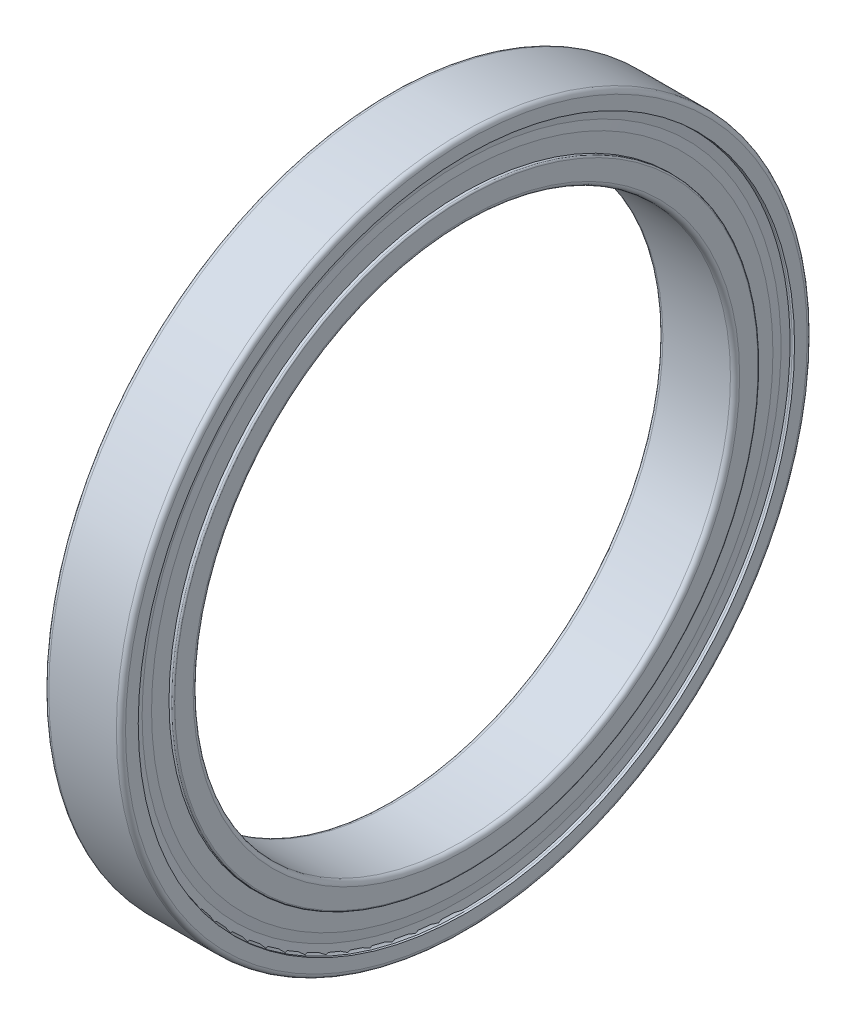
ISO-10303-21;
HEADER;
FILE_DESCRIPTION(('STEP AP214'),'2;1');
FILE_NAME('part.step','',(''),(''),'','','');
FILE_SCHEMA(('AUTOMOTIVE_DESIGN { 1 0 10303 214 1 1 1 1 }'));
ENDSEC;
DATA;
#1=APPLICATION_CONTEXT('core data for automotive mechanical design processes');
#2=APPLICATION_PROTOCOL_DEFINITION('international standard','automotive_design',2000,#1);
#3=PRODUCT_CONTEXT('',#1,'mechanical');
#4=PRODUCT('Part','Part','',(#3));
#5=PRODUCT_RELATED_PRODUCT_CATEGORY('part','',(#4));
#6=PRODUCT_DEFINITION_FORMATION('','',#4);
#7=PRODUCT_DEFINITION_CONTEXT('part definition',#1,'design');
#8=PRODUCT_DEFINITION('design','',#6,#7);
#9=PRODUCT_DEFINITION_SHAPE('','',#8);
#10=(LENGTH_UNIT() NAMED_UNIT(*) SI_UNIT(.MILLI.,.METRE.));
#11=(NAMED_UNIT(*) PLANE_ANGLE_UNIT() SI_UNIT($,.RADIAN.));
#12=(NAMED_UNIT(*) SI_UNIT($,.STERADIAN.) SOLID_ANGLE_UNIT());
#13=UNCERTAINTY_MEASURE_WITH_UNIT(LENGTH_MEASURE(1.E-05),#10,'distance_accuracy_value','');
#14=(GEOMETRIC_REPRESENTATION_CONTEXT(3) GLOBAL_UNCERTAINTY_ASSIGNED_CONTEXT((#13)) GLOBAL_UNIT_ASSIGNED_CONTEXT((#10,
#11,#12)) REPRESENTATION_CONTEXT('',''));
#15=CARTESIAN_POINT('',(0.,0.,0.));
#16=DIRECTION('',(0.,0.,1.));
#17=DIRECTION('',(1.,0.,0.));
#18=AXIS2_PLACEMENT_3D('',#15,#16,#17);
#19=CARTESIAN_POINT('',(5.,38.6370330515627,-10.3527618041008));
#20=DIRECTION('',(1.,0.,0.));
#21=DIRECTION('',(0.,0.965925826289068,-0.258819045102521));
#22=AXIS2_PLACEMENT_3D('',#19,#20,#21);
#23=SPHERICAL_SURFACE('',#22,2.778);
#24=CARTESIAN_POINT('',(7.778,38.6370330515627,-10.3527618041008));
#25=VERTEX_POINT('',#24);
#26=VERTEX_LOOP('',#25);
#27=FACE_BOUND('',#26,.T.);
#28=CARTESIAN_POINT('',(2.222,38.6370330515627,-10.3527618041008));
#29=VERTEX_POINT('',#28);
#30=VERTEX_LOOP('',#29);
#31=FACE_BOUND('',#30,.T.);
#32=ADVANCED_FACE('F46',(#27,#31),#23,.T.);
#33=CLOSED_SHELL('',(#32));
#34=MANIFOLD_SOLID_BREP('B2',#33);
#35=CARTESIAN_POINT('',(5.,34.6410161513775,-20.));
#36=DIRECTION('',(1.,0.,0.));
#37=DIRECTION('',(0.,0.866025403784438,-0.5));
#38=AXIS2_PLACEMENT_3D('',#35,#36,#37);
#39=SPHERICAL_SURFACE('',#38,2.778);
#40=CARTESIAN_POINT('',(7.778,34.6410161513775,-20.));
#41=VERTEX_POINT('',#40);
#42=VERTEX_LOOP('',#41);
#43=FACE_BOUND('',#42,.T.);
#44=CARTESIAN_POINT('',(2.222,34.6410161513775,-20.));
#45=VERTEX_POINT('',#44);
#46=VERTEX_LOOP('',#45);
#47=FACE_BOUND('',#46,.T.);
#48=ADVANCED_FACE('F73',(#43,#47),#39,.T.);
#49=CLOSED_SHELL('',(#48));
#50=MANIFOLD_SOLID_BREP('B6',#49);
#51=CARTESIAN_POINT('',(5.,28.2842712474619,-28.2842712474619));
#52=DIRECTION('',(1.,0.,0.));
#53=DIRECTION('',(0.,0.707106781186547,-0.707106781186548));
#54=AXIS2_PLACEMENT_3D('',#51,#52,#53);
#55=SPHERICAL_SURFACE('',#54,2.778);
#56=CARTESIAN_POINT('',(7.778,28.2842712474619,-28.2842712474619));
#57=VERTEX_POINT('',#56);
#58=VERTEX_LOOP('',#57);
#59=FACE_BOUND('',#58,.T.);
#60=CARTESIAN_POINT('',(2.222,28.2842712474619,-28.2842712474619));
#61=VERTEX_POINT('',#60);
#62=VERTEX_LOOP('',#61);
#63=FACE_BOUND('',#62,.T.);
#64=ADVANCED_FACE('F100',(#59,#63),#55,.T.);
#65=CLOSED_SHELL('',(#64));
#66=MANIFOLD_SOLID_BREP('B40',#65);
#67=CARTESIAN_POINT('',(5.,20.,-34.6410161513775));
#68=DIRECTION('',(1.,0.,0.));
#69=DIRECTION('',(0.,0.5,-0.866025403784439));
#70=AXIS2_PLACEMENT_3D('',#67,#68,#69);
#71=SPHERICAL_SURFACE('',#70,2.778);
#72=CARTESIAN_POINT('',(7.778,20.,-34.6410161513775));
#73=VERTEX_POINT('',#72);
#74=VERTEX_LOOP('',#73);
#75=FACE_BOUND('',#74,.T.);
#76=CARTESIAN_POINT('',(2.222,20.,-34.6410161513775));
#77=VERTEX_POINT('',#76);
#78=VERTEX_LOOP('',#77);
#79=FACE_BOUND('',#78,.T.);
#80=ADVANCED_FACE('F127',(#75,#79),#71,.T.);
#81=CLOSED_SHELL('',(#80));
#82=MANIFOLD_SOLID_BREP('B67',#81);
#83=CARTESIAN_POINT('',(5.,10.3527618041008,-38.6370330515627));
#84=DIRECTION('',(1.,0.,0.));
#85=DIRECTION('',(0.,0.25881904510252,-0.965925826289069));
#86=AXIS2_PLACEMENT_3D('',#83,#84,#85);
#87=SPHERICAL_SURFACE('',#86,2.778);
#88=CARTESIAN_POINT('',(7.778,10.3527618041008,-38.6370330515627));
#89=VERTEX_POINT('',#88);
#90=VERTEX_LOOP('',#89);
#91=FACE_BOUND('',#90,.T.);
#92=CARTESIAN_POINT('',(2.222,10.3527618041008,-38.6370330515627));
#93=VERTEX_POINT('',#92);
#94=VERTEX_LOOP('',#93);
#95=FACE_BOUND('',#94,.T.);
#96=ADVANCED_FACE('F154',(#91,#95),#87,.T.);
#97=CLOSED_SHELL('',(#96));
#98=MANIFOLD_SOLID_BREP('B94',#97);
#99=CARTESIAN_POINT('',(5.,0.,-40.));
#100=DIRECTION('',(1.,0.,0.));
#101=DIRECTION('',(0.,0.,-1.));
#102=AXIS2_PLACEMENT_3D('',#99,#100,#101);
#103=SPHERICAL_SURFACE('',#102,2.778);
#104=CARTESIAN_POINT('',(7.778,0.,-40.));
#105=VERTEX_POINT('',#104);
#106=VERTEX_LOOP('',#105);
#107=FACE_BOUND('',#106,.T.);
#108=CARTESIAN_POINT('',(2.222,0.,-40.));
#109=VERTEX_POINT('',#108);
#110=VERTEX_LOOP('',#109);
#111=FACE_BOUND('',#110,.T.);
#112=ADVANCED_FACE('F181',(#107,#111),#103,.T.);
#113=CLOSED_SHELL('',(#112));
#114=MANIFOLD_SOLID_BREP('B121',#113);
#115=CARTESIAN_POINT('',(5.,-10.3527618041008,-38.6370330515627));
#116=DIRECTION('',(1.,0.,0.));
#117=DIRECTION('',(0.,-0.258819045102521,-0.965925826289068));
#118=AXIS2_PLACEMENT_3D('',#115,#116,#117);
#119=SPHERICAL_SURFACE('',#118,2.778);
#120=CARTESIAN_POINT('',(7.778,-10.3527618041008,-38.6370330515627));
#121=VERTEX_POINT('',#120);
#122=VERTEX_LOOP('',#121);
#123=FACE_BOUND('',#122,.T.);
#124=CARTESIAN_POINT('',(2.222,-10.3527618041008,-38.6370330515627));
#125=VERTEX_POINT('',#124);
#126=VERTEX_LOOP('',#125);
#127=FACE_BOUND('',#126,.T.);
#128=ADVANCED_FACE('F208',(#123,#127),#119,.T.);
#129=CLOSED_SHELL('',(#128));
#130=MANIFOLD_SOLID_BREP('B148',#129);
#131=CARTESIAN_POINT('',(5.,-20.,-34.6410161513775));
#132=DIRECTION('',(1.,0.,0.));
#133=DIRECTION('',(0.,-0.5,-0.866025403784438));
#134=AXIS2_PLACEMENT_3D('',#131,#132,#133);
#135=SPHERICAL_SURFACE('',#134,2.778);
#136=CARTESIAN_POINT('',(7.778,-20.,-34.6410161513775));
#137=VERTEX_POINT('',#136);
#138=VERTEX_LOOP('',#137);
#139=FACE_BOUND('',#138,.T.);
#140=CARTESIAN_POINT('',(2.222,-20.,-34.6410161513775));
#141=VERTEX_POINT('',#140);
#142=VERTEX_LOOP('',#141);
#143=FACE_BOUND('',#142,.T.);
#144=ADVANCED_FACE('F235',(#139,#143),#135,.T.);
#145=CLOSED_SHELL('',(#144));
#146=MANIFOLD_SOLID_BREP('B175',#145);
#147=CARTESIAN_POINT('',(5.,-28.2842712474619,-28.2842712474619));
#148=DIRECTION('',(1.,0.,0.));
#149=DIRECTION('',(0.,-0.707106781186548,-0.707106781186547));
#150=AXIS2_PLACEMENT_3D('',#147,#148,#149);
#151=SPHERICAL_SURFACE('',#150,2.778);
#152=CARTESIAN_POINT('',(7.778,-28.2842712474619,-28.2842712474619));
#153=VERTEX_POINT('',#152);
#154=VERTEX_LOOP('',#153);
#155=FACE_BOUND('',#154,.T.);
#156=CARTESIAN_POINT('',(2.222,-28.2842712474619,-28.2842712474619));
#157=VERTEX_POINT('',#156);
#158=VERTEX_LOOP('',#157);
#159=FACE_BOUND('',#158,.T.);
#160=ADVANCED_FACE('F262',(#155,#159),#151,.T.);
#161=CLOSED_SHELL('',(#160));
#162=MANIFOLD_SOLID_BREP('B202',#161);
#163=CARTESIAN_POINT('',(5.,-34.6410161513775,-20.));
#164=DIRECTION('',(1.,0.,0.));
#165=DIRECTION('',(0.,-0.866025403784439,-0.5));
#166=AXIS2_PLACEMENT_3D('',#163,#164,#165);
#167=SPHERICAL_SURFACE('',#166,2.778);
#168=CARTESIAN_POINT('',(7.778,-34.6410161513775,-20.));
#169=VERTEX_POINT('',#168);
#170=VERTEX_LOOP('',#169);
#171=FACE_BOUND('',#170,.T.);
#172=CARTESIAN_POINT('',(2.222,-34.6410161513775,-20.));
#173=VERTEX_POINT('',#172);
#174=VERTEX_LOOP('',#173);
#175=FACE_BOUND('',#174,.T.);
#176=ADVANCED_FACE('F289',(#171,#175),#167,.T.);
#177=CLOSED_SHELL('',(#176));
#178=MANIFOLD_SOLID_BREP('B229',#177);
#179=CARTESIAN_POINT('',(5.,-38.6370330515627,-10.3527618041008));
#180=DIRECTION('',(1.,0.,0.));
#181=DIRECTION('',(0.,-0.965925826289068,-0.258819045102521));
#182=AXIS2_PLACEMENT_3D('',#179,#180,#181);
#183=SPHERICAL_SURFACE('',#182,2.778);
#184=CARTESIAN_POINT('',(7.778,-38.6370330515627,-10.3527618041008));
#185=VERTEX_POINT('',#184);
#186=VERTEX_LOOP('',#185);
#187=FACE_BOUND('',#186,.T.);
#188=CARTESIAN_POINT('',(2.222,-38.6370330515627,-10.3527618041008));
#189=VERTEX_POINT('',#188);
#190=VERTEX_LOOP('',#189);
#191=FACE_BOUND('',#190,.T.);
#192=ADVANCED_FACE('F316',(#187,#191),#183,.T.);
#193=CLOSED_SHELL('',(#192));
#194=MANIFOLD_SOLID_BREP('B256',#193);
#195=CARTESIAN_POINT('',(5.,-40.,0.));
#196=DIRECTION('',(1.,0.,0.));
#197=DIRECTION('',(0.,-1.,0.));
#198=AXIS2_PLACEMENT_3D('',#195,#196,#197);
#199=SPHERICAL_SURFACE('',#198,2.778);
#200=CARTESIAN_POINT('',(7.778,-40.,0.));
#201=VERTEX_POINT('',#200);
#202=VERTEX_LOOP('',#201);
#203=FACE_BOUND('',#202,.T.);
#204=CARTESIAN_POINT('',(2.222,-40.,0.));
#205=VERTEX_POINT('',#204);
#206=VERTEX_LOOP('',#205);
#207=FACE_BOUND('',#206,.T.);
#208=ADVANCED_FACE('F343',(#203,#207),#199,.T.);
#209=CLOSED_SHELL('',(#208));
#210=MANIFOLD_SOLID_BREP('B283',#209);
#211=CARTESIAN_POINT('',(5.,-38.6370330515627,10.3527618041008));
#212=DIRECTION('',(1.,0.,0.));
#213=DIRECTION('',(0.,-0.965925826289068,0.258819045102521));
#214=AXIS2_PLACEMENT_3D('',#211,#212,#213);
#215=SPHERICAL_SURFACE('',#214,2.778);
#216=CARTESIAN_POINT('',(7.778,-38.6370330515627,10.3527618041008));
#217=VERTEX_POINT('',#216);
#218=VERTEX_LOOP('',#217);
#219=FACE_BOUND('',#218,.T.);
#220=CARTESIAN_POINT('',(2.222,-38.6370330515627,10.3527618041008));
#221=VERTEX_POINT('',#220);
#222=VERTEX_LOOP('',#221);
#223=FACE_BOUND('',#222,.T.);
#224=ADVANCED_FACE('F370',(#219,#223),#215,.T.);
#225=CLOSED_SHELL('',(#224));
#226=MANIFOLD_SOLID_BREP('B310',#225);
#227=CARTESIAN_POINT('',(5.,-34.6410161513775,20.));
#228=DIRECTION('',(1.,0.,0.));
#229=DIRECTION('',(0.,-0.866025403784439,0.5));
#230=AXIS2_PLACEMENT_3D('',#227,#228,#229);
#231=SPHERICAL_SURFACE('',#230,2.778);
#232=CARTESIAN_POINT('',(7.778,-34.6410161513775,20.));
#233=VERTEX_POINT('',#232);
#234=VERTEX_LOOP('',#233);
#235=FACE_BOUND('',#234,.T.);
#236=CARTESIAN_POINT('',(2.222,-34.6410161513775,20.));
#237=VERTEX_POINT('',#236);
#238=VERTEX_LOOP('',#237);
#239=FACE_BOUND('',#238,.T.);
#240=ADVANCED_FACE('F397',(#235,#239),#231,.T.);
#241=CLOSED_SHELL('',(#240));
#242=MANIFOLD_SOLID_BREP('B337',#241);
#243=CARTESIAN_POINT('',(5.,-28.2842712474619,28.2842712474619));
#244=DIRECTION('',(1.,0.,0.));
#245=DIRECTION('',(0.,-0.707106781186547,0.707106781186548));
#246=AXIS2_PLACEMENT_3D('',#243,#244,#245);
#247=SPHERICAL_SURFACE('',#246,2.778);
#248=CARTESIAN_POINT('',(7.778,-28.2842712474619,28.2842712474619));
#249=VERTEX_POINT('',#248);
#250=VERTEX_LOOP('',#249);
#251=FACE_BOUND('',#250,.T.);
#252=CARTESIAN_POINT('',(2.222,-28.2842712474619,28.2842712474619));
#253=VERTEX_POINT('',#252);
#254=VERTEX_LOOP('',#253);
#255=FACE_BOUND('',#254,.T.);
#256=ADVANCED_FACE('F424',(#251,#255),#247,.T.);
#257=CLOSED_SHELL('',(#256));
#258=MANIFOLD_SOLID_BREP('B364',#257);
#259=CARTESIAN_POINT('',(5.,-20.,34.6410161513775));
#260=DIRECTION('',(1.,0.,0.));
#261=DIRECTION('',(0.,-0.5,0.866025403784439));
#262=AXIS2_PLACEMENT_3D('',#259,#260,#261);
#263=SPHERICAL_SURFACE('',#262,2.778);
#264=CARTESIAN_POINT('',(7.778,-20.,34.6410161513775));
#265=VERTEX_POINT('',#264);
#266=VERTEX_LOOP('',#265);
#267=FACE_BOUND('',#266,.T.);
#268=CARTESIAN_POINT('',(2.222,-20.,34.6410161513775));
#269=VERTEX_POINT('',#268);
#270=VERTEX_LOOP('',#269);
#271=FACE_BOUND('',#270,.T.);
#272=ADVANCED_FACE('F451',(#267,#271),#263,.T.);
#273=CLOSED_SHELL('',(#272));
#274=MANIFOLD_SOLID_BREP('B391',#273);
#275=CARTESIAN_POINT('',(5.,-10.3527618041008,38.6370330515627));
#276=DIRECTION('',(1.,0.,0.));
#277=DIRECTION('',(0.,-0.258819045102521,0.965925826289068));
#278=AXIS2_PLACEMENT_3D('',#275,#276,#277);
#279=SPHERICAL_SURFACE('',#278,2.778);
#280=CARTESIAN_POINT('',(7.778,-10.3527618041008,38.6370330515627));
#281=VERTEX_POINT('',#280);
#282=VERTEX_LOOP('',#281);
#283=FACE_BOUND('',#282,.T.);
#284=CARTESIAN_POINT('',(2.222,-10.3527618041008,38.6370330515627));
#285=VERTEX_POINT('',#284);
#286=VERTEX_LOOP('',#285);
#287=FACE_BOUND('',#286,.T.);
#288=ADVANCED_FACE('F478',(#283,#287),#279,.T.);
#289=CLOSED_SHELL('',(#288));
#290=MANIFOLD_SOLID_BREP('B418',#289);
#291=CARTESIAN_POINT('',(5.,0.,40.));
#292=DIRECTION('',(1.,0.,0.));
#293=DIRECTION('',(0.,0.,1.));
#294=AXIS2_PLACEMENT_3D('',#291,#292,#293);
#295=SPHERICAL_SURFACE('',#294,2.778);
#296=CARTESIAN_POINT('',(7.778,0.,40.));
#297=VERTEX_POINT('',#296);
#298=VERTEX_LOOP('',#297);
#299=FACE_BOUND('',#298,.T.);
#300=CARTESIAN_POINT('',(2.222,0.,40.));
#301=VERTEX_POINT('',#300);
#302=VERTEX_LOOP('',#301);
#303=FACE_BOUND('',#302,.T.);
#304=ADVANCED_FACE('F505',(#299,#303),#295,.T.);
#305=CLOSED_SHELL('',(#304));
#306=MANIFOLD_SOLID_BREP('B445',#305);
#307=CARTESIAN_POINT('',(5.,10.3527618041008,38.6370330515627));
#308=DIRECTION('',(1.,0.,0.));
#309=DIRECTION('',(0.,0.258819045102521,0.965925826289068));
#310=AXIS2_PLACEMENT_3D('',#307,#308,#309);
#311=SPHERICAL_SURFACE('',#310,2.778);
#312=CARTESIAN_POINT('',(7.778,10.3527618041008,38.6370330515627));
#313=VERTEX_POINT('',#312);
#314=VERTEX_LOOP('',#313);
#315=FACE_BOUND('',#314,.T.);
#316=CARTESIAN_POINT('',(2.222,10.3527618041008,38.6370330515627));
#317=VERTEX_POINT('',#316);
#318=VERTEX_LOOP('',#317);
#319=FACE_BOUND('',#318,.T.);
#320=ADVANCED_FACE('F532',(#315,#319),#311,.T.);
#321=CLOSED_SHELL('',(#320));
#322=MANIFOLD_SOLID_BREP('B472',#321);
#323=CARTESIAN_POINT('',(5.,20.,34.6410161513775));
#324=DIRECTION('',(1.,0.,0.));
#325=DIRECTION('',(0.,0.5,0.866025403784439));
#326=AXIS2_PLACEMENT_3D('',#323,#324,#325);
#327=SPHERICAL_SURFACE('',#326,2.778);
#328=CARTESIAN_POINT('',(7.778,20.,34.6410161513775));
#329=VERTEX_POINT('',#328);
#330=VERTEX_LOOP('',#329);
#331=FACE_BOUND('',#330,.T.);
#332=CARTESIAN_POINT('',(2.222,20.,34.6410161513775));
#333=VERTEX_POINT('',#332);
#334=VERTEX_LOOP('',#333);
#335=FACE_BOUND('',#334,.T.);
#336=ADVANCED_FACE('F559',(#331,#335),#327,.T.);
#337=CLOSED_SHELL('',(#336));
#338=MANIFOLD_SOLID_BREP('B499',#337);
#339=CARTESIAN_POINT('',(5.,28.2842712474619,28.2842712474619));
#340=DIRECTION('',(1.,0.,0.));
#341=DIRECTION('',(0.,0.707106781186548,0.707106781186548));
#342=AXIS2_PLACEMENT_3D('',#339,#340,#341);
#343=SPHERICAL_SURFACE('',#342,2.778);
#344=CARTESIAN_POINT('',(7.778,28.2842712474619,28.2842712474619));
#345=VERTEX_POINT('',#344);
#346=VERTEX_LOOP('',#345);
#347=FACE_BOUND('',#346,.T.);
#348=CARTESIAN_POINT('',(2.222,28.2842712474619,28.2842712474619));
#349=VERTEX_POINT('',#348);
#350=VERTEX_LOOP('',#349);
#351=FACE_BOUND('',#350,.T.);
#352=ADVANCED_FACE('F586',(#347,#351),#343,.T.);
#353=CLOSED_SHELL('',(#352));
#354=MANIFOLD_SOLID_BREP('B526',#353);
#355=CARTESIAN_POINT('',(5.,34.6410161513775,20.));
#356=DIRECTION('',(1.,0.,0.));
#357=DIRECTION('',(0.,0.866025403784439,0.5));
#358=AXIS2_PLACEMENT_3D('',#355,#356,#357);
#359=SPHERICAL_SURFACE('',#358,2.778);
#360=CARTESIAN_POINT('',(7.778,34.6410161513775,20.));
#361=VERTEX_POINT('',#360);
#362=VERTEX_LOOP('',#361);
#363=FACE_BOUND('',#362,.T.);
#364=CARTESIAN_POINT('',(2.222,34.6410161513775,20.));
#365=VERTEX_POINT('',#364);
#366=VERTEX_LOOP('',#365);
#367=FACE_BOUND('',#366,.T.);
#368=ADVANCED_FACE('F613',(#363,#367),#359,.T.);
#369=CLOSED_SHELL('',(#368));
#370=MANIFOLD_SOLID_BREP('B553',#369);
#371=CARTESIAN_POINT('',(5.,38.6370330515627,10.3527618041008));
#372=DIRECTION('',(1.,0.,0.));
#373=DIRECTION('',(0.,0.965925826289068,0.258819045102521));
#374=AXIS2_PLACEMENT_3D('',#371,#372,#373);
#375=SPHERICAL_SURFACE('',#374,2.778);
#376=CARTESIAN_POINT('',(7.778,38.6370330515627,10.3527618041008));
#377=VERTEX_POINT('',#376);
#378=VERTEX_LOOP('',#377);
#379=FACE_BOUND('',#378,.T.);
#380=CARTESIAN_POINT('',(2.222,38.6370330515627,10.3527618041008));
#381=VERTEX_POINT('',#380);
#382=VERTEX_LOOP('',#381);
#383=FACE_BOUND('',#382,.T.);
#384=ADVANCED_FACE('F640',(#379,#383),#375,.T.);
#385=CLOSED_SHELL('',(#384));
#386=MANIFOLD_SOLID_BREP('B580',#385);
#387=CARTESIAN_POINT('',(5.,40.,0.));
#388=DIRECTION('',(1.,0.,0.));
#389=DIRECTION('',(0.,1.,0.));
#390=AXIS2_PLACEMENT_3D('',#387,#388,#389);
#391=SPHERICAL_SURFACE('',#390,2.778);
#392=CARTESIAN_POINT('',(7.778,40.,0.));
#393=VERTEX_POINT('',#392);
#394=VERTEX_LOOP('',#393);
#395=FACE_BOUND('',#394,.T.);
#396=CARTESIAN_POINT('',(2.222,40.,0.));
#397=VERTEX_POINT('',#396);
#398=VERTEX_LOOP('',#397);
#399=FACE_BOUND('',#398,.T.);
#400=ADVANCED_FACE('F669',(#395,#399),#391,.T.);
#401=CLOSED_SHELL('',(#400));
#402=MANIFOLD_SOLID_BREP('B607',#401);
#403=CARTESIAN_POINT('',(0.6,0.,0.));
#404=DIRECTION('',(1.,0.,0.));
#405=DIRECTION('',(0.,0.,1.));
#406=AXIS2_PLACEMENT_3D('',#403,#404,#405);
#407=TOROIDAL_SURFACE('',#406,44.4,0.6);
#408=CARTESIAN_POINT('',(0.6,0.,0.));
#409=DIRECTION('',(-1.,0.,0.));
#410=DIRECTION('',(0.,0.,1.));
#411=AXIS2_PLACEMENT_3D('',#408,#409,#410);
#412=CIRCLE('',#411,45.);
#413=CARTESIAN_POINT('',(0.6,0.,45.));
#414=VERTEX_POINT('',#413);
#415=EDGE_CURVE('E714',#414,#414,#412,.T.);
#416=ORIENTED_EDGE('',*,*,#415,.T.);
#417=EDGE_LOOP('',(#416));
#418=FACE_BOUND('',#417,.T.);
#419=CARTESIAN_POINT('',(0.,0.,0.));
#420=DIRECTION('',(-1.,0.,0.));
#421=DIRECTION('',(0.,0.,1.));
#422=AXIS2_PLACEMENT_3D('',#419,#420,#421);
#423=CIRCLE('',#422,44.4);
#424=CARTESIAN_POINT('',(0.,0.,44.4));
#425=VERTEX_POINT('',#424);
#426=EDGE_CURVE('E667',#425,#425,#423,.T.);
#427=ORIENTED_EDGE('',*,*,#426,.F.);
#428=EDGE_LOOP('',(#427));
#429=FACE_BOUND('',#428,.T.);
#430=ADVANCED_FACE('F697',(#418,#429),#407,.T.);
#431=CARTESIAN_POINT('',(0.,44.4,0.));
#432=DIRECTION('',(-1.,0.,0.));
#433=DIRECTION('',(0.,0.,-1.));
#434=AXIS2_PLACEMENT_3D('',#431,#432,#433);
#435=PLANE('',#434);
#436=ORIENTED_EDGE('',*,*,#426,.T.);
#437=EDGE_LOOP('',(#436));
#438=FACE_BOUND('',#437,.T.);
#439=CARTESIAN_POINT('',(0.,0.,0.));
#440=DIRECTION('',(-1.,0.,0.));
#441=DIRECTION('',(0.,0.,1.));
#442=AXIS2_PLACEMENT_3D('',#439,#440,#441);
#443=CIRCLE('',#442,42.75);
#444=CARTESIAN_POINT('',(0.,0.,42.75));
#445=VERTEX_POINT('',#444);
#446=EDGE_CURVE('E707',#445,#445,#443,.T.);
#447=ORIENTED_EDGE('',*,*,#446,.F.);
#448=EDGE_LOOP('',(#447));
#449=FACE_BOUND('',#448,.T.);
#450=ADVANCED_FACE('F795',(#438,#449),#435,.T.);
#451=CARTESIAN_POINT('',(50.,0.,0.));
#452=DIRECTION('',(-1.,0.,0.));
#453=DIRECTION('',(0.,0.,1.));
#454=AXIS2_PLACEMENT_3D('',#451,#452,#453);
#455=CYLINDRICAL_SURFACE('',#454,42.75);
#456=ORIENTED_EDGE('',*,*,#446,.T.);
#457=EDGE_LOOP('',(#456));
#458=FACE_BOUND('',#457,.T.);
#459=CARTESIAN_POINT('',(0.300000000000009,0.,0.));
#460=DIRECTION('',(-1.,0.,0.));
#461=DIRECTION('',(0.,0.,1.));
#462=AXIS2_PLACEMENT_3D('',#459,#460,#461);
#463=CIRCLE('',#462,42.75);
#464=CARTESIAN_POINT('',(0.300000000000009,0.,42.75));
#465=VERTEX_POINT('',#464);
#466=EDGE_CURVE('E788',#465,#465,#463,.T.);
#467=ORIENTED_EDGE('',*,*,#466,.F.);
#468=EDGE_LOOP('',(#467));
#469=FACE_BOUND('',#468,.T.);
#470=ADVANCED_FACE('F793',(#458,#469),#455,.F.);
#471=CARTESIAN_POINT('',(0.3,0.,0.));
#472=DIRECTION('',(1.,0.,0.));
#473=DIRECTION('',(0.,0.,1.));
#474=AXIS2_PLACEMENT_3D('',#471,#472,#473);
#475=TOROIDAL_SURFACE('',#474,42.15,0.6);
#476=CARTESIAN_POINT('',(0.9,0.,0.));
#477=DIRECTION('',(-1.,0.,0.));
#478=DIRECTION('',(0.,0.,1.));
#479=AXIS2_PLACEMENT_3D('',#476,#477,#478);
#480=CIRCLE('',#479,42.15);
#481=CARTESIAN_POINT('',(0.9,0.,42.15));
#482=VERTEX_POINT('',#481);
#483=EDGE_CURVE('E743',#482,#482,#480,.T.);
#484=ORIENTED_EDGE('',*,*,#483,.F.);
#485=EDGE_LOOP('',(#484));
#486=FACE_BOUND('',#485,.T.);
#487=ORIENTED_EDGE('',*,*,#466,.T.);
#488=EDGE_LOOP('',(#487));
#489=FACE_BOUND('',#488,.T.);
#490=ADVANCED_FACE('F791',(#486,#489),#475,.F.);
#491=CARTESIAN_POINT('',(0.9,42.15,0.));
#492=DIRECTION('',(-1.,0.,0.));
#493=DIRECTION('',(0.,0.,-1.));
#494=AXIS2_PLACEMENT_3D('',#491,#492,#493);
#495=PLANE('',#494);
#496=ORIENTED_EDGE('',*,*,#483,.T.);
#497=EDGE_LOOP('',(#496));
#498=FACE_BOUND('',#497,.T.);
#499=CARTESIAN_POINT('',(0.9,0.,0.));
#500=DIRECTION('',(-1.,0.,0.));
#501=DIRECTION('',(0.,0.,1.));
#502=AXIS2_PLACEMENT_3D('',#499,#500,#501);
#503=CIRCLE('',#502,41.55);
#504=CARTESIAN_POINT('',(0.9,0.,41.55));
#505=VERTEX_POINT('',#504);
#506=EDGE_CURVE('E748',#505,#505,#503,.T.);
#507=ORIENTED_EDGE('',*,*,#506,.F.);
#508=EDGE_LOOP('',(#507));
#509=FACE_BOUND('',#508,.T.);
#510=ADVANCED_FACE('F801',(#498,#509),#495,.T.);
#511=CARTESIAN_POINT('',(50.,0.,0.));
#512=DIRECTION('',(-1.,0.,0.));
#513=DIRECTION('',(0.,0.,1.));
#514=AXIS2_PLACEMENT_3D('',#511,#512,#513);
#515=CYLINDRICAL_SURFACE('',#514,41.55);
#516=ORIENTED_EDGE('',*,*,#506,.T.);
#517=EDGE_LOOP('',(#516));
#518=FACE_BOUND('',#517,.T.);
#519=CARTESIAN_POINT('',(2.69461846975386,0.,0.));
#520=DIRECTION('',(-1.,0.,0.));
#521=DIRECTION('',(0.,0.,1.));
#522=AXIS2_PLACEMENT_3D('',#519,#520,#521);
#523=CIRCLE('',#522,41.55);
#524=CARTESIAN_POINT('',(2.69461846975386,0.,41.55));
#525=VERTEX_POINT('',#524);
#526=EDGE_CURVE('E764',#525,#525,#523,.T.);
#527=ORIENTED_EDGE('',*,*,#526,.F.);
#528=EDGE_LOOP('',(#527));
#529=FACE_BOUND('',#528,.T.);
#530=ADVANCED_FACE('F815',(#518,#529),#515,.F.);
#531=CARTESIAN_POINT('',(5.,0.,0.));
#532=DIRECTION('',(1.,0.,0.));
#533=DIRECTION('',(0.,0.,1.));
#534=AXIS2_PLACEMENT_3D('',#531,#532,#533);
#535=TOROIDAL_SURFACE('',#534,40.,2.778);
#536=CARTESIAN_POINT('',(7.30538153024614,0.,0.));
#537=DIRECTION('',(-1.,0.,0.));
#538=DIRECTION('',(0.,0.,1.));
#539=AXIS2_PLACEMENT_3D('',#536,#537,#538);
#540=CIRCLE('',#539,41.55);
#541=CARTESIAN_POINT('',(7.30538153024614,0.,41.55));
#542=VERTEX_POINT('',#541);
#543=EDGE_CURVE('E761',#542,#542,#540,.T.);
#544=ORIENTED_EDGE('',*,*,#543,.F.);
#545=EDGE_LOOP('',(#544));
#546=FACE_BOUND('',#545,.T.);
#547=ORIENTED_EDGE('',*,*,#526,.T.);
#548=EDGE_LOOP('',(#547));
#549=FACE_BOUND('',#548,.T.);
#550=CARTESIAN_POINT('',(5.,0.,42.778));
#551=VERTEX_POINT('',#550);
#552=VERTEX_LOOP('',#551);
#553=FACE_BOUND('',#552,.T.);
#554=ADVANCED_FACE('F826',(#546,#549,#553),#535,.F.);
#555=CARTESIAN_POINT('',(50.,0.,0.));
#556=DIRECTION('',(-1.,0.,0.));
#557=DIRECTION('',(0.,0.,1.));
#558=AXIS2_PLACEMENT_3D('',#555,#556,#557);
#559=CYLINDRICAL_SURFACE('',#558,41.55);
#560=ORIENTED_EDGE('',*,*,#543,.T.);
#561=EDGE_LOOP('',(#560));
#562=FACE_BOUND('',#561,.T.);
#563=CARTESIAN_POINT('',(9.1,0.,0.));
#564=DIRECTION('',(-1.,0.,0.));
#565=DIRECTION('',(0.,0.,1.));
#566=AXIS2_PLACEMENT_3D('',#563,#564,#565);
#567=CIRCLE('',#566,41.55);
#568=CARTESIAN_POINT('',(9.1,0.,41.55));
#569=VERTEX_POINT('',#568);
#570=EDGE_CURVE('E758',#569,#569,#567,.T.);
#571=ORIENTED_EDGE('',*,*,#570,.F.);
#572=EDGE_LOOP('',(#571));
#573=FACE_BOUND('',#572,.T.);
#574=ADVANCED_FACE('F829',(#562,#573),#559,.F.);
#575=CARTESIAN_POINT('',(9.1,41.55,0.));
#576=DIRECTION('',(1.,0.,0.));
#577=DIRECTION('',(0.,1.,0.));
#578=AXIS2_PLACEMENT_3D('',#575,#576,#577);
#579=PLANE('',#578);
#580=CARTESIAN_POINT('',(9.1,0.,0.));
#581=DIRECTION('',(-1.,0.,0.));
#582=DIRECTION('',(0.,0.,1.));
#583=AXIS2_PLACEMENT_3D('',#580,#581,#582);
#584=CIRCLE('',#583,42.15);
#585=CARTESIAN_POINT('',(9.1,0.,42.15));
#586=VERTEX_POINT('',#585);
#587=EDGE_CURVE('E762',#586,#586,#584,.T.);
#588=ORIENTED_EDGE('',*,*,#587,.F.);
#589=EDGE_LOOP('',(#588));
#590=FACE_BOUND('',#589,.T.);
#591=ORIENTED_EDGE('',*,*,#570,.T.);
#592=EDGE_LOOP('',(#591));
#593=FACE_BOUND('',#592,.T.);
#594=ADVANCED_FACE('F759',(#590,#593),#579,.T.);
#595=CARTESIAN_POINT('',(9.7,0.,0.));
#596=DIRECTION('',(1.,0.,0.));
#597=DIRECTION('',(0.,0.,1.));
#598=AXIS2_PLACEMENT_3D('',#595,#596,#597);
#599=TOROIDAL_SURFACE('',#598,42.15,0.6);
#600=CARTESIAN_POINT('',(9.7,0.,0.));
#601=DIRECTION('',(-1.,0.,0.));
#602=DIRECTION('',(0.,0.,1.));
#603=AXIS2_PLACEMENT_3D('',#600,#601,#602);
#604=CIRCLE('',#603,42.75);
#605=CARTESIAN_POINT('',(9.7,0.,42.75));
#606=VERTEX_POINT('',#605);
#607=EDGE_CURVE('E766',#606,#606,#604,.T.);
#608=ORIENTED_EDGE('',*,*,#607,.F.);
#609=EDGE_LOOP('',(#608));
#610=FACE_BOUND('',#609,.T.);
#611=ORIENTED_EDGE('',*,*,#587,.T.);
#612=EDGE_LOOP('',(#611));
#613=FACE_BOUND('',#612,.T.);
#614=ADVANCED_FACE('F819',(#610,#613),#599,.F.);
#615=CARTESIAN_POINT('',(50.,0.,0.));
#616=DIRECTION('',(-1.,0.,0.));
#617=DIRECTION('',(0.,0.,1.));
#618=AXIS2_PLACEMENT_3D('',#615,#616,#617);
#619=CYLINDRICAL_SURFACE('',#618,42.75);
#620=ORIENTED_EDGE('',*,*,#607,.T.);
#621=EDGE_LOOP('',(#620));
#622=FACE_BOUND('',#621,.T.);
#623=CARTESIAN_POINT('',(10.,0.,0.));
#624=DIRECTION('',(-1.,0.,0.));
#625=DIRECTION('',(0.,0.,1.));
#626=AXIS2_PLACEMENT_3D('',#623,#624,#625);
#627=CIRCLE('',#626,42.75);
#628=CARTESIAN_POINT('',(10.,0.,42.75));
#629=VERTEX_POINT('',#628);
#630=EDGE_CURVE('E701',#629,#629,#627,.T.);
#631=ORIENTED_EDGE('',*,*,#630,.F.);
#632=EDGE_LOOP('',(#631));
#633=FACE_BOUND('',#632,.T.);
#634=ADVANCED_FACE('F816',(#622,#633),#619,.F.);
#635=CARTESIAN_POINT('',(10.,42.75,0.));
#636=DIRECTION('',(1.,0.,0.));
#637=DIRECTION('',(0.,1.,0.));
#638=AXIS2_PLACEMENT_3D('',#635,#636,#637);
#639=PLANE('',#638);
#640=CARTESIAN_POINT('',(10.,0.,0.));
#641=DIRECTION('',(-1.,0.,0.));
#642=DIRECTION('',(0.,0.,1.));
#643=AXIS2_PLACEMENT_3D('',#640,#641,#642);
#644=CIRCLE('',#643,44.4);
#645=CARTESIAN_POINT('',(10.,0.,44.4));
#646=VERTEX_POINT('',#645);
#647=EDGE_CURVE('E769',#646,#646,#644,.T.);
#648=ORIENTED_EDGE('',*,*,#647,.F.);
#649=EDGE_LOOP('',(#648));
#650=FACE_BOUND('',#649,.T.);
#651=ORIENTED_EDGE('',*,*,#630,.T.);
#652=EDGE_LOOP('',(#651));
#653=FACE_BOUND('',#652,.T.);
#654=ADVANCED_FACE('F818',(#650,#653),#639,.T.);
#655=CARTESIAN_POINT('',(9.4,0.,0.));
#656=DIRECTION('',(1.,0.,0.));
#657=DIRECTION('',(0.,0.,1.));
#658=AXIS2_PLACEMENT_3D('',#655,#656,#657);
#659=TOROIDAL_SURFACE('',#658,44.4,0.6);
#660=ORIENTED_EDGE('',*,*,#647,.T.);
#661=EDGE_LOOP('',(#660));
#662=FACE_BOUND('',#661,.T.);
#663=CARTESIAN_POINT('',(9.4,0.,0.));
#664=DIRECTION('',(-1.,0.,0.));
#665=DIRECTION('',(0.,0.,1.));
#666=AXIS2_PLACEMENT_3D('',#663,#664,#665);
#667=CIRCLE('',#666,45.);
#668=CARTESIAN_POINT('',(9.4,0.,45.));
#669=VERTEX_POINT('',#668);
#670=EDGE_CURVE('E776',#669,#669,#667,.T.);
#671=ORIENTED_EDGE('',*,*,#670,.F.);
#672=EDGE_LOOP('',(#671));
#673=FACE_BOUND('',#672,.T.);
#674=ADVANCED_FACE('F821',(#662,#673),#659,.T.);
#675=CARTESIAN_POINT('',(50.,0.,0.));
#676=DIRECTION('',(-1.,0.,0.));
#677=DIRECTION('',(0.,0.,1.));
#678=AXIS2_PLACEMENT_3D('',#675,#676,#677);
#679=CYLINDRICAL_SURFACE('',#678,45.);
#680=ORIENTED_EDGE('',*,*,#670,.T.);
#681=EDGE_LOOP('',(#680));
#682=FACE_BOUND('',#681,.T.);
#683=ORIENTED_EDGE('',*,*,#415,.F.);
#684=EDGE_LOOP('',(#683));
#685=FACE_BOUND('',#684,.T.);
#686=ADVANCED_FACE('F699',(#682,#685),#679,.T.);
#687=CLOSED_SHELL('',(#430,#450,#470,#490,#510,#530,#554,#574,#594,#614,#634,#654,#674,#686));
#688=MANIFOLD_SOLID_BREP('B634',#687);
#689=CARTESIAN_POINT('',(9.1,41.6125,0.));
#690=DIRECTION('',(-1.,0.,0.));
#691=DIRECTION('',(0.,0.,-1.));
#692=AXIS2_PLACEMENT_3D('',#689,#690,#691);
#693=PLANE('',#692);
#694=CARTESIAN_POINT('',(9.1,0.,0.));
#695=DIRECTION('',(-1.,0.,0.));
#696=DIRECTION('',(0.,0.,1.));
#697=AXIS2_PLACEMENT_3D('',#694,#695,#696);
#698=CIRCLE('',#697,41.6125);
#699=CARTESIAN_POINT('',(9.1,0.,41.6125));
#700=VERTEX_POINT('',#699);
#701=EDGE_CURVE('E956',#700,#700,#698,.T.);
#702=ORIENTED_EDGE('',*,*,#701,.T.);
#703=EDGE_LOOP('',(#702));
#704=FACE_BOUND('',#703,.T.);
#705=CARTESIAN_POINT('',(9.1,0.,0.));
#706=DIRECTION('',(-1.,0.,0.));
#707=DIRECTION('',(0.,0.,1.));
#708=AXIS2_PLACEMENT_3D('',#705,#706,#707);
#709=CIRCLE('',#708,40.475);
#710=CARTESIAN_POINT('',(9.1,0.,40.475));
#711=VERTEX_POINT('',#710);
#712=EDGE_CURVE('E695',#711,#711,#709,.T.);
#713=ORIENTED_EDGE('',*,*,#712,.F.);
#714=EDGE_LOOP('',(#713));
#715=FACE_BOUND('',#714,.T.);
#716=ADVANCED_FACE('F939',(#704,#715),#693,.T.);
#717=CARTESIAN_POINT('',(9.1,0.,0.));
#718=DIRECTION('',(-1.,0.,0.));
#719=DIRECTION('',(0.,0.,-1.));
#720=AXIS2_PLACEMENT_3D('',#717,#718,#719);
#721=CONICAL_SURFACE('',#720,40.475,1.4918399322);
#722=ORIENTED_EDGE('',*,*,#712,.T.);
#723=EDGE_LOOP('',(#722));
#724=FACE_BOUND('',#723,.T.);
#725=CARTESIAN_POINT('',(9.28,0.,0.));
#726=DIRECTION('',(-1.,0.,0.));
#727=DIRECTION('',(0.,0.,1.));
#728=AXIS2_PLACEMENT_3D('',#725,#726,#727);
#729=CIRCLE('',#728,38.2);
#730=CARTESIAN_POINT('',(9.28,0.,38.2));
#731=VERTEX_POINT('',#730);
#732=EDGE_CURVE('E949',#731,#731,#729,.T.);
#733=ORIENTED_EDGE('',*,*,#732,.F.);
#734=EDGE_LOOP('',(#733));
#735=FACE_BOUND('',#734,.T.);
#736=ADVANCED_FACE('F1069',(#724,#735),#721,.F.);
#737=CARTESIAN_POINT('',(0.9,0.,0.));
#738=DIRECTION('',(-1.,0.,0.));
#739=DIRECTION('',(0.,0.,-1.));
#740=AXIS2_PLACEMENT_3D('',#737,#738,#739);
#741=CONICAL_SURFACE('',#740,41.6125,1.4138558876);
#742=CARTESIAN_POINT('',(0.72,0.,0.));
#743=DIRECTION('',(-1.,0.,0.));
#744=DIRECTION('',(0.,0.,1.));
#745=AXIS2_PLACEMENT_3D('',#742,#743,#744);
#746=CIRCLE('',#745,42.75);
#747=CARTESIAN_POINT('',(0.72,0.,42.75));
#748=VERTEX_POINT('',#747);
#749=EDGE_CURVE('E980',#748,#748,#746,.T.);
#750=ORIENTED_EDGE('',*,*,#749,.F.);
#751=EDGE_LOOP('',(#750));
#752=FACE_BOUND('',#751,.T.);
#753=CARTESIAN_POINT('',(0.9,0.,0.));
#754=DIRECTION('',(-1.,0.,0.));
#755=DIRECTION('',(0.,0.,1.));
#756=AXIS2_PLACEMENT_3D('',#753,#754,#755);
#757=CIRCLE('',#756,41.6125);
#758=CARTESIAN_POINT('',(0.9,0.,41.6125));
#759=VERTEX_POINT('',#758);
#760=EDGE_CURVE('E995',#759,#759,#757,.T.);
#761=ORIENTED_EDGE('',*,*,#760,.T.);
#762=EDGE_LOOP('',(#761));
#763=FACE_BOUND('',#762,.T.);
#764=ADVANCED_FACE('F1073',(#752,#763),#741,.T.);
#765=CARTESIAN_POINT('',(50.,0.,0.));
#766=DIRECTION('',(-1.,0.,0.));
#767=DIRECTION('',(0.,0.,1.));
#768=AXIS2_PLACEMENT_3D('',#765,#766,#767);
#769=CYLINDRICAL_SURFACE('',#768,38.2);
#770=ORIENTED_EDGE('',*,*,#732,.T.);
#771=EDGE_LOOP('',(#770));
#772=FACE_BOUND('',#771,.T.);
#773=CARTESIAN_POINT('',(7.11595935688756,0.,0.));
#774=DIRECTION('',(-1.,0.,0.));
#775=DIRECTION('',(0.,0.,1.));
#776=AXIS2_PLACEMENT_3D('',#773,#774,#775);
#777=CIRCLE('',#776,38.2);
#778=CARTESIAN_POINT('',(7.11595935688756,0.,38.2));
#779=VERTEX_POINT('',#778);
#780=EDGE_CURVE('E981',#779,#779,#777,.T.);
#781=ORIENTED_EDGE('',*,*,#780,.F.);
#782=EDGE_LOOP('',(#781));
#783=FACE_BOUND('',#782,.T.);
#784=ADVANCED_FACE('F977',(#772,#783),#769,.T.);
#785=CARTESIAN_POINT('',(50.,0.,0.));
#786=DIRECTION('',(-1.,0.,0.));
#787=DIRECTION('',(0.,0.,1.));
#788=AXIS2_PLACEMENT_3D('',#785,#786,#787);
#789=CYLINDRICAL_SURFACE('',#788,38.2);
#790=CARTESIAN_POINT('',(0.54,0.,0.));
#791=DIRECTION('',(-1.,0.,0.));
#792=DIRECTION('',(0.,0.,1.));
#793=AXIS2_PLACEMENT_3D('',#790,#791,#792);
#794=CIRCLE('',#793,38.2);
#795=CARTESIAN_POINT('',(0.54,0.,38.2));
#796=VERTEX_POINT('',#795);
#797=EDGE_CURVE('E1015',#796,#796,#794,.T.);
#798=ORIENTED_EDGE('',*,*,#797,.T.);
#799=EDGE_LOOP('',(#798));
#800=FACE_BOUND('',#799,.T.);
#801=CARTESIAN_POINT('',(0.2,0.,0.));
#802=DIRECTION('',(-1.,0.,0.));
#803=DIRECTION('',(0.,0.,1.));
#804=AXIS2_PLACEMENT_3D('',#801,#802,#803);
#805=CIRCLE('',#804,38.2);
#806=CARTESIAN_POINT('',(0.2,0.,38.2));
#807=VERTEX_POINT('',#806);
#808=EDGE_CURVE('E986',#807,#807,#805,.T.);
#809=ORIENTED_EDGE('',*,*,#808,.F.);
#810=EDGE_LOOP('',(#809));
#811=FACE_BOUND('',#810,.T.);
#812=ADVANCED_FACE('F1082',(#800,#811),#789,.T.);
#813=CARTESIAN_POINT('',(50.,0.,0.));
#814=DIRECTION('',(-1.,0.,0.));
#815=DIRECTION('',(0.,0.,1.));
#816=AXIS2_PLACEMENT_3D('',#813,#814,#815);
#817=CYLINDRICAL_SURFACE('',#816,38.2);
#818=CARTESIAN_POINT('',(9.8,0.,0.));
#819=DIRECTION('',(-1.,0.,0.));
#820=DIRECTION('',(0.,0.,1.));
#821=AXIS2_PLACEMENT_3D('',#818,#819,#820);
#822=CIRCLE('',#821,38.2);
#823=CARTESIAN_POINT('',(9.8,0.,38.2));
#824=VERTEX_POINT('',#823);
#825=EDGE_CURVE('E1026',#824,#824,#822,.T.);
#826=ORIENTED_EDGE('',*,*,#825,.T.);
#827=EDGE_LOOP('',(#826));
#828=FACE_BOUND('',#827,.T.);
#829=CARTESIAN_POINT('',(9.46,0.,0.));
#830=DIRECTION('',(-1.,0.,0.));
#831=DIRECTION('',(0.,0.,1.));
#832=AXIS2_PLACEMENT_3D('',#829,#830,#831);
#833=CIRCLE('',#832,38.2);
#834=CARTESIAN_POINT('',(9.46,0.,38.2));
#835=VERTEX_POINT('',#834);
#836=EDGE_CURVE('E1018',#835,#835,#833,.T.);
#837=ORIENTED_EDGE('',*,*,#836,.F.);
#838=EDGE_LOOP('',(#837));
#839=FACE_BOUND('',#838,.T.);
#840=ADVANCED_FACE('F1078',(#828,#839),#817,.T.);
#841=CARTESIAN_POINT('',(5.,0.,0.));
#842=DIRECTION('',(1.,0.,0.));
#843=DIRECTION('',(0.,0.,1.));
#844=AXIS2_PLACEMENT_3D('',#841,#842,#843);
#845=TOROIDAL_SURFACE('',#844,40.,2.778);
#846=CARTESIAN_POINT('',(2.88404064311244,0.,0.));
#847=DIRECTION('',(-1.,0.,0.));
#848=DIRECTION('',(0.,0.,1.));
#849=AXIS2_PLACEMENT_3D('',#846,#847,#848);
#850=CIRCLE('',#849,38.2);
#851=CARTESIAN_POINT('',(2.88404064311244,0.,38.2));
#852=VERTEX_POINT('',#851);
#853=EDGE_CURVE('E943',#852,#852,#850,.T.);
#854=ORIENTED_EDGE('',*,*,#853,.F.);
#855=EDGE_LOOP('',(#854));
#856=FACE_BOUND('',#855,.T.);
#857=ORIENTED_EDGE('',*,*,#780,.T.);
#858=EDGE_LOOP('',(#857));
#859=FACE_BOUND('',#858,.T.);
#860=ADVANCED_FACE('F1081',(#856,#859),#845,.F.);
#861=CARTESIAN_POINT('',(9.8,0.,0.));
#862=DIRECTION('',(1.,0.,0.));
#863=DIRECTION('',(0.,0.,1.));
#864=AXIS2_PLACEMENT_3D('',#861,#862,#863);
#865=TOROIDAL_SURFACE('',#864,38.,0.2);
#866=CARTESIAN_POINT('',(10.,0.,0.));
#867=DIRECTION('',(-1.,0.,0.));
#868=DIRECTION('',(0.,0.,1.));
#869=AXIS2_PLACEMENT_3D('',#866,#867,#868);
#870=CIRCLE('',#869,38.);
#871=CARTESIAN_POINT('',(10.,0.,38.));
#872=VERTEX_POINT('',#871);
#873=EDGE_CURVE('E1023',#872,#872,#870,.T.);
#874=ORIENTED_EDGE('',*,*,#873,.T.);
#875=EDGE_LOOP('',(#874));
#876=FACE_BOUND('',#875,.T.);
#877=ORIENTED_EDGE('',*,*,#825,.F.);
#878=EDGE_LOOP('',(#877));
#879=FACE_BOUND('',#878,.T.);
#880=ADVANCED_FACE('F1133',(#876,#879),#865,.T.);
#881=CARTESIAN_POINT('',(10.,35.6,0.));
#882=DIRECTION('',(1.,0.,0.));
#883=DIRECTION('',(0.,1.,0.));
#884=AXIS2_PLACEMENT_3D('',#881,#882,#883);
#885=PLANE('',#884);
#886=ORIENTED_EDGE('',*,*,#873,.F.);
#887=EDGE_LOOP('',(#886));
#888=FACE_BOUND('',#887,.T.);
#889=CARTESIAN_POINT('',(10.,0.,0.));
#890=DIRECTION('',(-1.,0.,0.));
#891=DIRECTION('',(0.,0.,1.));
#892=AXIS2_PLACEMENT_3D('',#889,#890,#891);
#893=CIRCLE('',#892,35.6);
#894=CARTESIAN_POINT('',(10.,0.,35.6));
#895=VERTEX_POINT('',#894);
#896=EDGE_CURVE('E1010',#895,#895,#893,.T.);
#897=ORIENTED_EDGE('',*,*,#896,.T.);
#898=EDGE_LOOP('',(#897));
#899=FACE_BOUND('',#898,.T.);
#900=ADVANCED_FACE('F1122',(#888,#899),#885,.T.);
#901=CARTESIAN_POINT('',(9.4,0.,0.));
#902=DIRECTION('',(1.,0.,0.));
#903=DIRECTION('',(0.,0.,1.));
#904=AXIS2_PLACEMENT_3D('',#901,#902,#903);
#905=TOROIDAL_SURFACE('',#904,35.6,0.6);
#906=CARTESIAN_POINT('',(9.4,0.,0.));
#907=DIRECTION('',(-1.,0.,0.));
#908=DIRECTION('',(0.,0.,1.));
#909=AXIS2_PLACEMENT_3D('',#906,#907,#908);
#910=CIRCLE('',#909,35.);
#911=CARTESIAN_POINT('',(9.4,0.,35.));
#912=VERTEX_POINT('',#911);
#913=EDGE_CURVE('E1007',#912,#912,#910,.T.);
#914=ORIENTED_EDGE('',*,*,#913,.T.);
#915=EDGE_LOOP('',(#914));
#916=FACE_BOUND('',#915,.T.);
#917=ORIENTED_EDGE('',*,*,#896,.F.);
#918=EDGE_LOOP('',(#917));
#919=FACE_BOUND('',#918,.T.);
#920=ADVANCED_FACE('F1110',(#916,#919),#905,.T.);
#921=CARTESIAN_POINT('',(50.,0.,0.));
#922=DIRECTION('',(-1.,0.,0.));
#923=DIRECTION('',(0.,0.,1.));
#924=AXIS2_PLACEMENT_3D('',#921,#922,#923);
#925=CYLINDRICAL_SURFACE('',#924,35.);
#926=CARTESIAN_POINT('',(0.6,0.,0.));
#927=DIRECTION('',(-1.,0.,0.));
#928=DIRECTION('',(0.,0.,1.));
#929=AXIS2_PLACEMENT_3D('',#926,#927,#928);
#930=CIRCLE('',#929,35.);
#931=CARTESIAN_POINT('',(0.6,0.,35.));
#932=VERTEX_POINT('',#931);
#933=EDGE_CURVE('E1003',#932,#932,#930,.T.);
#934=ORIENTED_EDGE('',*,*,#933,.T.);
#935=EDGE_LOOP('',(#934));
#936=FACE_BOUND('',#935,.T.);
#937=ORIENTED_EDGE('',*,*,#913,.F.);
#938=EDGE_LOOP('',(#937));
#939=FACE_BOUND('',#938,.T.);
#940=ADVANCED_FACE('F1107',(#936,#939),#925,.F.);
#941=CARTESIAN_POINT('',(0.59999999999999,0.,0.));
#942=DIRECTION('',(1.,0.,0.));
#943=DIRECTION('',(0.,0.,1.));
#944=AXIS2_PLACEMENT_3D('',#941,#942,#943);
#945=TOROIDAL_SURFACE('',#944,35.6,0.6);
#946=CARTESIAN_POINT('',(0.,0.,0.));
#947=DIRECTION('',(-1.,0.,0.));
#948=DIRECTION('',(0.,0.,1.));
#949=AXIS2_PLACEMENT_3D('',#946,#947,#948);
#950=CIRCLE('',#949,35.6);
#951=CARTESIAN_POINT('',(0.,0.,35.6));
#952=VERTEX_POINT('',#951);
#953=EDGE_CURVE('E1001',#952,#952,#950,.T.);
#954=ORIENTED_EDGE('',*,*,#953,.T.);
#955=EDGE_LOOP('',(#954));
#956=FACE_BOUND('',#955,.T.);
#957=ORIENTED_EDGE('',*,*,#933,.F.);
#958=EDGE_LOOP('',(#957));
#959=FACE_BOUND('',#958,.T.);
#960=ADVANCED_FACE('F1109',(#956,#959),#945,.T.);
#961=CARTESIAN_POINT('',(0.,38.,0.));
#962=DIRECTION('',(-1.,0.,0.));
#963=DIRECTION('',(0.,0.,-1.));
#964=AXIS2_PLACEMENT_3D('',#961,#962,#963);
#965=PLANE('',#964);
#966=CARTESIAN_POINT('',(0.,0.,0.));
#967=DIRECTION('',(-1.,0.,0.));
#968=DIRECTION('',(0.,0.,1.));
#969=AXIS2_PLACEMENT_3D('',#966,#967,#968);
#970=CIRCLE('',#969,38.);
#971=CARTESIAN_POINT('',(0.,0.,38.));
#972=VERTEX_POINT('',#971);
#973=EDGE_CURVE('E1004',#972,#972,#970,.T.);
#974=ORIENTED_EDGE('',*,*,#973,.T.);
#975=EDGE_LOOP('',(#974));
#976=FACE_BOUND('',#975,.T.);
#977=ORIENTED_EDGE('',*,*,#953,.F.);
#978=EDGE_LOOP('',(#977));
#979=FACE_BOUND('',#978,.T.);
#980=ADVANCED_FACE('F1115',(#976,#979),#965,.T.);
#981=CARTESIAN_POINT('',(0.200000000000007,0.,0.));
#982=DIRECTION('',(1.,0.,0.));
#983=DIRECTION('',(0.,0.,1.));
#984=AXIS2_PLACEMENT_3D('',#981,#982,#983);
#985=TOROIDAL_SURFACE('',#984,38.,0.2);
#986=ORIENTED_EDGE('',*,*,#808,.T.);
#987=EDGE_LOOP('',(#986));
#988=FACE_BOUND('',#987,.T.);
#989=ORIENTED_EDGE('',*,*,#973,.F.);
#990=EDGE_LOOP('',(#989));
#991=FACE_BOUND('',#990,.T.);
#992=ADVANCED_FACE('F1064',(#988,#991),#985,.T.);
#993=CARTESIAN_POINT('',(0.54,40.475,0.));
#994=DIRECTION('',(-1.,0.,0.));
#995=DIRECTION('',(0.,0.,-1.));
#996=AXIS2_PLACEMENT_3D('',#993,#994,#995);
#997=PLANE('',#996);
#998=CARTESIAN_POINT('',(0.54,0.,0.));
#999=DIRECTION('',(-1.,0.,0.));
#1000=DIRECTION('',(0.,0.,1.));
#1001=AXIS2_PLACEMENT_3D('',#998,#999,#1000);
#1002=CIRCLE('',#1001,40.475);
#1003=CARTESIAN_POINT('',(0.54,0.,40.475));
#1004=VERTEX_POINT('',#1003);
#1005=EDGE_CURVE('E1021',#1004,#1004,#1002,.T.);
#1006=ORIENTED_EDGE('',*,*,#1005,.T.);
#1007=EDGE_LOOP('',(#1006));
#1008=FACE_BOUND('',#1007,.T.);
#1009=ORIENTED_EDGE('',*,*,#797,.F.);
#1010=EDGE_LOOP('',(#1009));
#1011=FACE_BOUND('',#1010,.T.);
#1012=ADVANCED_FACE('F1047',(#1008,#1011),#997,.T.);
#1013=CARTESIAN_POINT('',(0.63,0.,0.));
#1014=DIRECTION('',(1.,0.,0.));
#1015=DIRECTION('',(0.,0.,1.));
#1016=AXIS2_PLACEMENT_3D('',#1013,#1014,#1015);
#1017=CONICAL_SURFACE('',#1016,41.6125,1.4918399322);
#1018=CARTESIAN_POINT('',(0.63,0.,0.));
#1019=DIRECTION('',(-1.,0.,0.));
#1020=DIRECTION('',(0.,0.,1.));
#1021=AXIS2_PLACEMENT_3D('',#1018,#1019,#1020);
#1022=CIRCLE('',#1021,41.6125);
#1023=CARTESIAN_POINT('',(0.63,0.,41.6125));
#1024=VERTEX_POINT('',#1023);
#1025=EDGE_CURVE('E1031',#1024,#1024,#1022,.T.);
#1026=ORIENTED_EDGE('',*,*,#1025,.T.);
#1027=EDGE_LOOP('',(#1026));
#1028=FACE_BOUND('',#1027,.T.);
#1029=ORIENTED_EDGE('',*,*,#1005,.F.);
#1030=EDGE_LOOP('',(#1029));
#1031=FACE_BOUND('',#1030,.T.);
#1032=ADVANCED_FACE('F1053',(#1028,#1031),#1017,.T.);
#1033=CARTESIAN_POINT('',(0.54,0.,0.));
#1034=DIRECTION('',(-1.,0.,0.));
#1035=DIRECTION('',(0.,0.,-1.));
#1036=AXIS2_PLACEMENT_3D('',#1033,#1034,#1035);
#1037=CONICAL_SURFACE('',#1036,42.75,1.4918399322);
#1038=CARTESIAN_POINT('',(0.54,0.,0.));
#1039=DIRECTION('',(-1.,0.,0.));
#1040=DIRECTION('',(0.,0.,1.));
#1041=AXIS2_PLACEMENT_3D('',#1038,#1039,#1040);
#1042=CIRCLE('',#1041,42.75);
#1043=CARTESIAN_POINT('',(0.54,0.,42.75));
#1044=VERTEX_POINT('',#1043);
#1045=EDGE_CURVE('E1034',#1044,#1044,#1042,.T.);
#1046=ORIENTED_EDGE('',*,*,#1045,.T.);
#1047=EDGE_LOOP('',(#1046));
#1048=FACE_BOUND('',#1047,.T.);
#1049=ORIENTED_EDGE('',*,*,#1025,.F.);
#1050=EDGE_LOOP('',(#1049));
#1051=FACE_BOUND('',#1050,.T.);
#1052=ADVANCED_FACE('F1055',(#1048,#1051),#1037,.F.);
#1053=CARTESIAN_POINT('',(50.,0.,0.));
#1054=DIRECTION('',(-1.,0.,0.));
#1055=DIRECTION('',(0.,0.,1.));
#1056=AXIS2_PLACEMENT_3D('',#1053,#1054,#1055);
#1057=CYLINDRICAL_SURFACE('',#1056,42.75);
#1058=ORIENTED_EDGE('',*,*,#749,.T.);
#1059=EDGE_LOOP('',(#1058));
#1060=FACE_BOUND('',#1059,.T.);
#1061=ORIENTED_EDGE('',*,*,#1045,.F.);
#1062=EDGE_LOOP('',(#1061));
#1063=FACE_BOUND('',#1062,.T.);
#1064=ADVANCED_FACE('F941',(#1060,#1063),#1057,.T.);
#1065=CARTESIAN_POINT('',(0.9,40.475,0.));
#1066=DIRECTION('',(1.,0.,0.));
#1067=DIRECTION('',(0.,1.,0.));
#1068=AXIS2_PLACEMENT_3D('',#1065,#1066,#1067);
#1069=PLANE('',#1068);
#1070=ORIENTED_EDGE('',*,*,#760,.F.);
#1071=EDGE_LOOP('',(#1070));
#1072=FACE_BOUND('',#1071,.T.);
#1073=CARTESIAN_POINT('',(0.9,0.,0.));
#1074=DIRECTION('',(-1.,0.,0.));
#1075=DIRECTION('',(0.,0.,1.));
#1076=AXIS2_PLACEMENT_3D('',#1073,#1074,#1075);
#1077=CIRCLE('',#1076,40.475);
#1078=CARTESIAN_POINT('',(0.9,0.,40.475));
#1079=VERTEX_POINT('',#1078);
#1080=EDGE_CURVE('E992',#1079,#1079,#1077,.T.);
#1081=ORIENTED_EDGE('',*,*,#1080,.T.);
#1082=EDGE_LOOP('',(#1081));
#1083=FACE_BOUND('',#1082,.T.);
#1084=ADVANCED_FACE('F1084',(#1072,#1083),#1069,.T.);
#1085=CARTESIAN_POINT('',(0.72,0.,0.));
#1086=DIRECTION('',(1.,0.,0.));
#1087=DIRECTION('',(0.,0.,1.));
#1088=AXIS2_PLACEMENT_3D('',#1085,#1086,#1087);
#1089=CONICAL_SURFACE('',#1088,38.2,1.4918399322);
#1090=ORIENTED_EDGE('',*,*,#1080,.F.);
#1091=EDGE_LOOP('',(#1090));
#1092=FACE_BOUND('',#1091,.T.);
#1093=CARTESIAN_POINT('',(0.72,0.,0.));
#1094=DIRECTION('',(-1.,0.,0.));
#1095=DIRECTION('',(0.,0.,1.));
#1096=AXIS2_PLACEMENT_3D('',#1093,#1094,#1095);
#1097=CIRCLE('',#1096,38.2);
#1098=CARTESIAN_POINT('',(0.72,0.,38.2));
#1099=VERTEX_POINT('',#1098);
#1100=EDGE_CURVE('E990',#1099,#1099,#1097,.T.);
#1101=ORIENTED_EDGE('',*,*,#1100,.T.);
#1102=EDGE_LOOP('',(#1101));
#1103=FACE_BOUND('',#1102,.T.);
#1104=ADVANCED_FACE('F1087',(#1092,#1103),#1089,.F.);
#1105=CARTESIAN_POINT('',(50.,0.,0.));
#1106=DIRECTION('',(-1.,0.,0.));
#1107=DIRECTION('',(0.,0.,1.));
#1108=AXIS2_PLACEMENT_3D('',#1105,#1106,#1107);
#1109=CYLINDRICAL_SURFACE('',#1108,38.2);
#1110=ORIENTED_EDGE('',*,*,#853,.T.);
#1111=EDGE_LOOP('',(#1110));
#1112=FACE_BOUND('',#1111,.T.);
#1113=ORIENTED_EDGE('',*,*,#1100,.F.);
#1114=EDGE_LOOP('',(#1113));
#1115=FACE_BOUND('',#1114,.T.);
#1116=ADVANCED_FACE('F1096',(#1112,#1115),#1109,.T.);
#1117=CARTESIAN_POINT('',(9.46,38.2,0.));
#1118=DIRECTION('',(1.,0.,0.));
#1119=DIRECTION('',(0.,1.,0.));
#1120=AXIS2_PLACEMENT_3D('',#1117,#1118,#1119);
#1121=PLANE('',#1120);
#1122=CARTESIAN_POINT('',(9.46,0.,0.));
#1123=DIRECTION('',(-1.,0.,0.));
#1124=DIRECTION('',(0.,0.,1.));
#1125=AXIS2_PLACEMENT_3D('',#1122,#1123,#1124);
#1126=CIRCLE('',#1125,40.475);
#1127=CARTESIAN_POINT('',(9.46,0.,40.475));
#1128=VERTEX_POINT('',#1127);
#1129=EDGE_CURVE('E987',#1128,#1128,#1126,.T.);
#1130=ORIENTED_EDGE('',*,*,#1129,.F.);
#1131=EDGE_LOOP('',(#1130));
#1132=FACE_BOUND('',#1131,.T.);
#1133=ORIENTED_EDGE('',*,*,#836,.T.);
#1134=EDGE_LOOP('',(#1133));
#1135=FACE_BOUND('',#1134,.T.);
#1136=ADVANCED_FACE('F1092',(#1132,#1135),#1121,.T.);
#1137=CARTESIAN_POINT('',(9.46,0.,0.));
#1138=DIRECTION('',(-1.,0.,0.));
#1139=DIRECTION('',(0.,0.,-1.));
#1140=AXIS2_PLACEMENT_3D('',#1137,#1138,#1139);
#1141=CONICAL_SURFACE('',#1140,40.475,1.4918399322);
#1142=CARTESIAN_POINT('',(9.37,0.,0.));
#1143=DIRECTION('',(-1.,0.,0.));
#1144=DIRECTION('',(0.,0.,1.));
#1145=AXIS2_PLACEMENT_3D('',#1142,#1143,#1144);
#1146=CIRCLE('',#1145,41.6125);
#1147=CARTESIAN_POINT('',(9.37,0.,41.6125));
#1148=VERTEX_POINT('',#1147);
#1149=EDGE_CURVE('E991',#1148,#1148,#1146,.T.);
#1150=ORIENTED_EDGE('',*,*,#1149,.F.);
#1151=EDGE_LOOP('',(#1150));
#1152=FACE_BOUND('',#1151,.T.);
#1153=ORIENTED_EDGE('',*,*,#1129,.T.);
#1154=EDGE_LOOP('',(#1153));
#1155=FACE_BOUND('',#1154,.T.);
#1156=ADVANCED_FACE('F1095',(#1152,#1155),#1141,.T.);
#1157=CARTESIAN_POINT('',(9.37,0.,0.));
#1158=DIRECTION('',(1.,0.,0.));
#1159=DIRECTION('',(0.,0.,1.));
#1160=AXIS2_PLACEMENT_3D('',#1157,#1158,#1159);
#1161=CONICAL_SURFACE('',#1160,41.6125,1.4918399322);
#1162=CARTESIAN_POINT('',(9.46,0.,0.));
#1163=DIRECTION('',(-1.,0.,0.));
#1164=DIRECTION('',(0.,0.,1.));
#1165=AXIS2_PLACEMENT_3D('',#1162,#1163,#1164);
#1166=CIRCLE('',#1165,42.75);
#1167=CARTESIAN_POINT('',(9.46,0.,42.75));
#1168=VERTEX_POINT('',#1167);
#1169=EDGE_CURVE('E1000',#1168,#1168,#1166,.T.);
#1170=ORIENTED_EDGE('',*,*,#1169,.F.);
#1171=EDGE_LOOP('',(#1170));
#1172=FACE_BOUND('',#1171,.T.);
#1173=ORIENTED_EDGE('',*,*,#1149,.T.);
#1174=EDGE_LOOP('',(#1173));
#1175=FACE_BOUND('',#1174,.T.);
#1176=ADVANCED_FACE('F1098',(#1172,#1175),#1161,.F.);
#1177=CARTESIAN_POINT('',(50.,0.,0.));
#1178=DIRECTION('',(-1.,0.,0.));
#1179=DIRECTION('',(0.,0.,1.));
#1180=AXIS2_PLACEMENT_3D('',#1177,#1178,#1179);
#1181=CYLINDRICAL_SURFACE('',#1180,42.75);
#1182=ORIENTED_EDGE('',*,*,#1169,.T.);
#1183=EDGE_LOOP('',(#1182));
#1184=FACE_BOUND('',#1183,.T.);
#1185=CARTESIAN_POINT('',(9.28,0.,0.));
#1186=DIRECTION('',(-1.,0.,0.));
#1187=DIRECTION('',(0.,0.,1.));
#1188=AXIS2_PLACEMENT_3D('',#1185,#1186,#1187);
#1189=CIRCLE('',#1188,42.75);
#1190=CARTESIAN_POINT('',(9.28,0.,42.75));
#1191=VERTEX_POINT('',#1190);
#1192=EDGE_CURVE('E997',#1191,#1191,#1189,.T.);
#1193=ORIENTED_EDGE('',*,*,#1192,.F.);
#1194=EDGE_LOOP('',(#1193));
#1195=FACE_BOUND('',#1194,.T.);
#1196=ADVANCED_FACE('F1101',(#1184,#1195),#1181,.T.);
#1197=CARTESIAN_POINT('',(9.28,0.,0.));
#1198=DIRECTION('',(1.,0.,0.));
#1199=DIRECTION('',(0.,0.,1.));
#1200=AXIS2_PLACEMENT_3D('',#1197,#1198,#1199);
#1201=CONICAL_SURFACE('',#1200,42.75,1.4138558876);
#1202=ORIENTED_EDGE('',*,*,#1192,.T.);
#1203=EDGE_LOOP('',(#1202));
#1204=FACE_BOUND('',#1203,.T.);
#1205=ORIENTED_EDGE('',*,*,#701,.F.);
#1206=EDGE_LOOP('',(#1205));
#1207=FACE_BOUND('',#1206,.T.);
#1208=ADVANCED_FACE('F1103',(#1204,#1207),#1201,.T.);
#1209=CLOSED_SHELL('',(#716,#736,#764,#784,#812,#840,#860,#880,#900,#920,#940,#960,#980,#992,
#1012,#1032,#1052,#1064,#1084,#1104,#1116,#1136,#1156,#1176,#1196,#1208));
#1210=MANIFOLD_SOLID_BREP('B661',#1209);
#1211=ADVANCED_BREP_SHAPE_REPRESENTATION('',(#18,#34,#50,#66,#82,#98,#114,#130,#146,#162,#178,
#194,#210,#226,#242,#258,#274,#290,#306,#322,#338,#354,#370,#386,#402,#688,#1210),#14);
#1212=SHAPE_DEFINITION_REPRESENTATION(#9,#1211);
ENDSEC;
END-ISO-10303-21;
